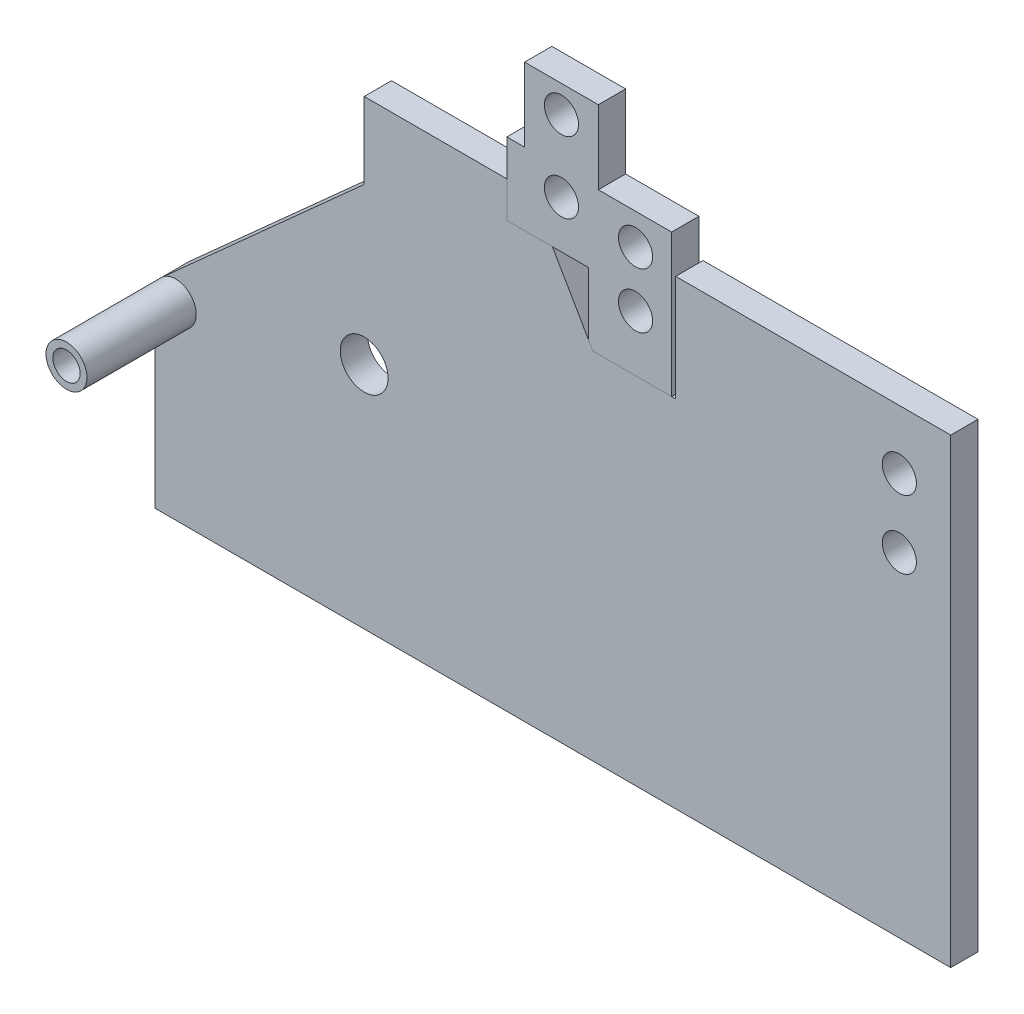
ISO-10303-21;
HEADER;
FILE_DESCRIPTION(('STEP AP214'),'2;1');
FILE_NAME('part.step','',(''),(''),'','','');
FILE_SCHEMA(('AUTOMOTIVE_DESIGN { 1 0 10303 214 1 1 1 1 }'));
ENDSEC;
DATA;
#1=APPLICATION_CONTEXT('core data for automotive mechanical design processes');
#2=APPLICATION_PROTOCOL_DEFINITION('international standard','automotive_design',2000,#1);
#3=PRODUCT_CONTEXT('',#1,'mechanical');
#4=PRODUCT('Part','Part','',(#3));
#5=PRODUCT_RELATED_PRODUCT_CATEGORY('part','',(#4));
#6=PRODUCT_DEFINITION_FORMATION('','',#4);
#7=PRODUCT_DEFINITION_CONTEXT('part definition',#1,'design');
#8=PRODUCT_DEFINITION('design','',#6,#7);
#9=PRODUCT_DEFINITION_SHAPE('','',#8);
#10=(LENGTH_UNIT() NAMED_UNIT(*) SI_UNIT(.MILLI.,.METRE.));
#11=(NAMED_UNIT(*) PLANE_ANGLE_UNIT() SI_UNIT($,.RADIAN.));
#12=(NAMED_UNIT(*) SI_UNIT($,.STERADIAN.) SOLID_ANGLE_UNIT());
#13=UNCERTAINTY_MEASURE_WITH_UNIT(LENGTH_MEASURE(1.E-05),#10,'distance_accuracy_value','');
#14=(GEOMETRIC_REPRESENTATION_CONTEXT(3) GLOBAL_UNCERTAINTY_ASSIGNED_CONTEXT((#13)) GLOBAL_UNIT_ASSIGNED_CONTEXT((#10,
#11,#12)) REPRESENTATION_CONTEXT('',''));
#15=CARTESIAN_POINT('',(0.,0.,0.));
#16=DIRECTION('',(0.,0.,1.));
#17=DIRECTION('',(1.,0.,0.));
#18=AXIS2_PLACEMENT_3D('',#15,#16,#17);
#19=CARTESIAN_POINT('',(0.,260.,0.));
#20=DIRECTION('',(0.,1.,0.));
#21=DIRECTION('',(0.,0.,1.));
#22=AXIS2_PLACEMENT_3D('',#19,#20,#21);
#23=PLANE('',#22);
#24=DIRECTION('',(-1.,0.,0.));
#25=VECTOR('',#24,1.);
#26=CARTESIAN_POINT('',(0.,260.,20.));
#27=LINE('',#26,#25);
#28=CARTESIAN_POINT('',(378.12049576549,260.,20.));
#29=VERTEX_POINT('',#28);
#30=CARTESIAN_POINT('',(320.509364461751,260.,20.));
#31=VERTEX_POINT('',#30);
#32=EDGE_CURVE('E249',#29,#31,#27,.T.);
#33=ORIENTED_EDGE('',*,*,#32,.T.);
#34=DIRECTION('',(0.,0.,1.));
#35=VECTOR('',#34,1.);
#36=CARTESIAN_POINT('',(320.509364461751,260.,0.));
#37=LINE('',#36,#35);
#38=CARTESIAN_POINT('',(320.509364461751,260.,0.));
#39=VERTEX_POINT('',#38);
#40=EDGE_CURVE('E13',#39,#31,#37,.T.);
#41=ORIENTED_EDGE('',*,*,#40,.F.);
#42=DIRECTION('',(-1.,0.,0.));
#43=VECTOR('',#42,1.);
#44=CARTESIAN_POINT('',(0.,260.,0.));
#45=LINE('',#44,#43);
#46=CARTESIAN_POINT('',(378.12049576549,260.,0.));
#47=VERTEX_POINT('',#46);
#48=EDGE_CURVE('E285',#47,#39,#45,.T.);
#49=ORIENTED_EDGE('',*,*,#48,.F.);
#50=DIRECTION('',(0.,0.,1.));
#51=VECTOR('',#50,1.);
#52=CARTESIAN_POINT('',(378.12049576549,260.,0.));
#53=LINE('',#52,#51);
#54=EDGE_CURVE('E124',#47,#29,#53,.T.);
#55=ORIENTED_EDGE('',*,*,#54,.T.);
#56=EDGE_LOOP('',(#33,#41,#49,#55));
#57=FACE_BOUND('',#56,.T.);
#58=ADVANCED_FACE('F121',(#57),#23,.F.);
#59=CARTESIAN_POINT('',(352.96532583829,203.784625887341,0.));
#60=DIRECTION('',(0.866025403784438,0.5,0.));
#61=DIRECTION('',(-0.5,0.866025403784438,0.));
#62=AXIS2_PLACEMENT_3D('',#59,#60,#61);
#63=PLANE('',#62);
#64=DIRECTION('',(-0.5,0.866025403784438,0.));
#65=VECTOR('',#64,1.);
#66=CARTESIAN_POINT('',(352.96532583829,203.784625887341,20.));
#67=LINE('',#66,#65);
#68=CARTESIAN_POINT('',(317.180522157063,265.765724002103,20.));
#69=VERTEX_POINT('',#68);
#70=EDGE_CURVE('E173',#31,#69,#67,.T.);
#71=ORIENTED_EDGE('',*,*,#70,.T.);
#72=DIRECTION('',(0.,0.,1.));
#73=VECTOR('',#72,1.);
#74=CARTESIAN_POINT('',(317.180522157063,265.765724002103,0.));
#75=LINE('',#74,#73);
#76=CARTESIAN_POINT('',(317.180522157063,265.765724002103,0.));
#77=VERTEX_POINT('',#76);
#78=EDGE_CURVE('E130',#77,#69,#75,.T.);
#79=ORIENTED_EDGE('',*,*,#78,.F.);
#80=DIRECTION('',(-0.5,0.866025403784438,0.));
#81=VECTOR('',#80,1.);
#82=CARTESIAN_POINT('',(352.96532583829,203.784625887341,0.));
#83=LINE('',#82,#81);
#84=EDGE_CURVE('E138',#39,#77,#83,.T.);
#85=ORIENTED_EDGE('',*,*,#84,.F.);
#86=ORIENTED_EDGE('',*,*,#40,.T.);
#87=EDGE_LOOP('',(#71,#79,#85,#86));
#88=FACE_BOUND('',#87,.T.);
#89=ADVANCED_FACE('F323',(#88),#63,.F.);
#90=CARTESIAN_POINT('',(317.180522157063,0.,0.));
#91=DIRECTION('',(1.,0.,0.));
#92=DIRECTION('',(0.,0.,-1.));
#93=AXIS2_PLACEMENT_3D('',#90,#91,#92);
#94=PLANE('',#93);
#95=DIRECTION('',(0.,1.,0.));
#96=VECTOR('',#95,1.);
#97=CARTESIAN_POINT('',(317.180522157063,0.,20.));
#98=LINE('',#97,#96);
#99=CARTESIAN_POINT('',(317.180522157063,311.384042750519,20.));
#100=VERTEX_POINT('',#99);
#101=EDGE_CURVE('E222',#69,#100,#98,.T.);
#102=ORIENTED_EDGE('',*,*,#101,.T.);
#103=DIRECTION('',(0.,0.,1.));
#104=VECTOR('',#103,1.);
#105=CARTESIAN_POINT('',(317.180522157063,311.384042750519,0.));
#106=LINE('',#105,#104);
#107=CARTESIAN_POINT('',(317.180522157063,311.384042750519,0.));
#108=VERTEX_POINT('',#107);
#109=EDGE_CURVE('E220',#108,#100,#106,.T.);
#110=ORIENTED_EDGE('',*,*,#109,.F.);
#111=DIRECTION('',(0.,1.,0.));
#112=VECTOR('',#111,1.);
#113=CARTESIAN_POINT('',(317.180522157063,0.,0.));
#114=LINE('',#113,#112);
#115=EDGE_CURVE('E209',#77,#108,#114,.T.);
#116=ORIENTED_EDGE('',*,*,#115,.F.);
#117=ORIENTED_EDGE('',*,*,#78,.T.);
#118=EDGE_LOOP('',(#102,#110,#116,#117));
#119=FACE_BOUND('',#118,.T.);
#120=ADVANCED_FACE('F221',(#119),#94,.F.);
#121=CARTESIAN_POINT('',(0.,311.384042750519,0.));
#122=DIRECTION('',(0.,1.,0.));
#123=DIRECTION('',(0.,0.,1.));
#124=AXIS2_PLACEMENT_3D('',#121,#122,#123);
#125=PLANE('',#124);
#126=DIRECTION('',(-1.,0.,0.));
#127=VECTOR('',#126,1.);
#128=CARTESIAN_POINT('',(0.,311.384042750519,20.));
#129=LINE('',#128,#127);
#130=CARTESIAN_POINT('',(257.46049576549,311.384042750519,20.));
#131=VERTEX_POINT('',#130);
#132=EDGE_CURVE('E270',#100,#131,#129,.T.);
#133=ORIENTED_EDGE('',*,*,#132,.T.);
#134=DIRECTION('',(0.,0.,1.));
#135=VECTOR('',#134,1.);
#136=CARTESIAN_POINT('',(257.46049576549,311.384042750519,0.));
#137=LINE('',#136,#135);
#138=CARTESIAN_POINT('',(257.46049576549,311.384042750519,0.));
#139=VERTEX_POINT('',#138);
#140=EDGE_CURVE('E226',#139,#131,#137,.T.);
#141=ORIENTED_EDGE('',*,*,#140,.F.);
#142=DIRECTION('',(-1.,0.,0.));
#143=VECTOR('',#142,1.);
#144=CARTESIAN_POINT('',(0.,311.384042750519,0.));
#145=LINE('',#144,#143);
#146=EDGE_CURVE('E215',#108,#139,#145,.T.);
#147=ORIENTED_EDGE('',*,*,#146,.F.);
#148=ORIENTED_EDGE('',*,*,#109,.T.);
#149=EDGE_LOOP('',(#133,#141,#147,#148));
#150=FACE_BOUND('',#149,.T.);
#151=ADVANCED_FACE('F228',(#150),#125,.F.);
#152=CARTESIAN_POINT('',(257.46049576549,0.,0.));
#153=DIRECTION('',(-1.,0.,0.));
#154=DIRECTION('',(0.,0.,1.));
#155=AXIS2_PLACEMENT_3D('',#152,#153,#154);
#156=PLANE('',#155);
#157=DIRECTION('',(0.,-1.,0.));
#158=VECTOR('',#157,1.);
#159=CARTESIAN_POINT('',(257.46049576549,0.,20.));
#160=LINE('',#159,#158);
#161=CARTESIAN_POINT('',(257.46049576549,364.320187298071,20.));
#162=VERTEX_POINT('',#161);
#163=EDGE_CURVE('E267',#162,#131,#160,.T.);
#164=ORIENTED_EDGE('',*,*,#163,.F.);
#165=DIRECTION('',(0.,0.,1.));
#166=VECTOR('',#165,1.);
#167=CARTESIAN_POINT('',(257.46049576549,364.320187298071,0.));
#168=LINE('',#167,#166);
#169=CARTESIAN_POINT('',(257.46049576549,364.320187298071,0.));
#170=VERTEX_POINT('',#169);
#171=EDGE_CURVE('E289',#170,#162,#168,.T.);
#172=ORIENTED_EDGE('',*,*,#171,.F.);
#173=DIRECTION('',(0.,-1.,0.));
#174=VECTOR('',#173,1.);
#175=CARTESIAN_POINT('',(257.46049576549,0.,0.));
#176=LINE('',#175,#174);
#177=EDGE_CURVE('E230',#170,#139,#176,.T.);
#178=ORIENTED_EDGE('',*,*,#177,.T.);
#179=ORIENTED_EDGE('',*,*,#140,.T.);
#180=EDGE_LOOP('',(#164,#172,#178,#179));
#181=FACE_BOUND('',#180,.T.);
#182=ADVANCED_FACE('F336',(#181),#156,.T.);
#183=CARTESIAN_POINT('',(0.,364.320187298071,0.));
#184=DIRECTION('',(0.,-1.,0.));
#185=DIRECTION('',(0.,0.,-1.));
#186=AXIS2_PLACEMENT_3D('',#183,#184,#185);
#187=PLANE('',#186);
#188=DIRECTION('',(1.,0.,0.));
#189=VECTOR('',#188,1.);
#190=CARTESIAN_POINT('',(0.,364.320187298071,20.));
#191=LINE('',#190,#189);
#192=CARTESIAN_POINT('',(270.46049576549,364.320187298071,20.));
#193=VERTEX_POINT('',#192);
#194=EDGE_CURVE('E265',#162,#193,#191,.T.);
#195=ORIENTED_EDGE('',*,*,#194,.T.);
#196=DIRECTION('',(0.,0.,1.));
#197=VECTOR('',#196,1.);
#198=CARTESIAN_POINT('',(270.46049576549,364.320187298071,0.));
#199=LINE('',#198,#197);
#200=CARTESIAN_POINT('',(270.46049576549,364.320187298071,0.));
#201=VERTEX_POINT('',#200);
#202=EDGE_CURVE('E291',#201,#193,#199,.T.);
#203=ORIENTED_EDGE('',*,*,#202,.F.);
#204=DIRECTION('',(1.,0.,0.));
#205=VECTOR('',#204,1.);
#206=CARTESIAN_POINT('',(0.,364.320187298071,0.));
#207=LINE('',#206,#205);
#208=EDGE_CURVE('E232',#170,#201,#207,.T.);
#209=ORIENTED_EDGE('',*,*,#208,.F.);
#210=ORIENTED_EDGE('',*,*,#171,.T.);
#211=EDGE_LOOP('',(#195,#203,#209,#210));
#212=FACE_BOUND('',#211,.T.);
#213=ADVANCED_FACE('F339',(#212),#187,.F.);
#214=CARTESIAN_POINT('',(270.46049576549,0.,0.));
#215=DIRECTION('',(1.,0.,0.));
#216=DIRECTION('',(0.,0.,-1.));
#217=AXIS2_PLACEMENT_3D('',#214,#215,#216);
#218=PLANE('',#217);
#219=DIRECTION('',(0.,1.,0.));
#220=VECTOR('',#219,1.);
#221=CARTESIAN_POINT('',(270.46049576549,0.,20.));
#222=LINE('',#221,#220);
#223=CARTESIAN_POINT('',(270.46049576549,418.251615442449,20.));
#224=VERTEX_POINT('',#223);
#225=EDGE_CURVE('E263',#193,#224,#222,.T.);
#226=ORIENTED_EDGE('',*,*,#225,.T.);
#227=DIRECTION('',(0.,0.,1.));
#228=VECTOR('',#227,1.);
#229=CARTESIAN_POINT('',(270.46049576549,418.251615442449,0.));
#230=LINE('',#229,#228);
#231=CARTESIAN_POINT('',(270.46049576549,418.251615442449,0.));
#232=VERTEX_POINT('',#231);
#233=EDGE_CURVE('E294',#232,#224,#230,.T.);
#234=ORIENTED_EDGE('',*,*,#233,.F.);
#235=DIRECTION('',(0.,1.,0.));
#236=VECTOR('',#235,1.);
#237=CARTESIAN_POINT('',(270.46049576549,0.,0.));
#238=LINE('',#237,#236);
#239=EDGE_CURVE('E377',#201,#232,#238,.T.);
#240=ORIENTED_EDGE('',*,*,#239,.F.);
#241=ORIENTED_EDGE('',*,*,#202,.T.);
#242=EDGE_LOOP('',(#226,#234,#240,#241));
#243=FACE_BOUND('',#242,.T.);
#244=ADVANCED_FACE('F343',(#243),#218,.F.);
#245=CARTESIAN_POINT('',(0.,418.251615442449,0.));
#246=DIRECTION('',(0.,-1.,0.));
#247=DIRECTION('',(0.,0.,-1.));
#248=AXIS2_PLACEMENT_3D('',#245,#246,#247);
#249=PLANE('',#248);
#250=DIRECTION('',(1.,0.,0.));
#251=VECTOR('',#250,1.);
#252=CARTESIAN_POINT('',(0.,418.251615442449,20.));
#253=LINE('',#252,#251);
#254=CARTESIAN_POINT('',(324.46049576549,418.251615442449,20.));
#255=VERTEX_POINT('',#254);
#256=EDGE_CURVE('E261',#224,#255,#253,.T.);
#257=ORIENTED_EDGE('',*,*,#256,.T.);
#258=DIRECTION('',(0.,0.,1.));
#259=VECTOR('',#258,1.);
#260=CARTESIAN_POINT('',(324.46049576549,418.251615442449,0.));
#261=LINE('',#260,#259);
#262=CARTESIAN_POINT('',(324.46049576549,418.251615442449,0.));
#263=VERTEX_POINT('',#262);
#264=EDGE_CURVE('E297',#263,#255,#261,.T.);
#265=ORIENTED_EDGE('',*,*,#264,.F.);
#266=DIRECTION('',(1.,0.,0.));
#267=VECTOR('',#266,1.);
#268=CARTESIAN_POINT('',(0.,418.251615442449,0.));
#269=LINE('',#268,#267);
#270=EDGE_CURVE('E374',#232,#263,#269,.T.);
#271=ORIENTED_EDGE('',*,*,#270,.F.);
#272=ORIENTED_EDGE('',*,*,#233,.T.);
#273=EDGE_LOOP('',(#257,#265,#271,#272));
#274=FACE_BOUND('',#273,.T.);
#275=ADVANCED_FACE('F347',(#274),#249,.F.);
#276=CARTESIAN_POINT('',(324.46049576549,0.,0.));
#277=DIRECTION('',(-1.,0.,0.));
#278=DIRECTION('',(0.,0.,1.));
#279=AXIS2_PLACEMENT_3D('',#276,#277,#278);
#280=PLANE('',#279);
#281=DIRECTION('',(0.,-1.,0.));
#282=VECTOR('',#281,1.);
#283=CARTESIAN_POINT('',(324.46049576549,0.,20.));
#284=LINE('',#283,#282);
#285=CARTESIAN_POINT('',(324.46049576549,364.320187298071,20.));
#286=VERTEX_POINT('',#285);
#287=EDGE_CURVE('E258',#255,#286,#284,.T.);
#288=ORIENTED_EDGE('',*,*,#287,.T.);
#289=DIRECTION('',(0.,0.,1.));
#290=VECTOR('',#289,1.);
#291=CARTESIAN_POINT('',(324.46049576549,364.320187298071,0.));
#292=LINE('',#291,#290);
#293=CARTESIAN_POINT('',(324.46049576549,364.320187298071,0.));
#294=VERTEX_POINT('',#293);
#295=EDGE_CURVE('E300',#294,#286,#292,.T.);
#296=ORIENTED_EDGE('',*,*,#295,.F.);
#297=DIRECTION('',(0.,-1.,0.));
#298=VECTOR('',#297,1.);
#299=CARTESIAN_POINT('',(324.46049576549,0.,0.));
#300=LINE('',#299,#298);
#301=EDGE_CURVE('E372',#263,#294,#300,.T.);
#302=ORIENTED_EDGE('',*,*,#301,.F.);
#303=ORIENTED_EDGE('',*,*,#264,.T.);
#304=EDGE_LOOP('',(#288,#296,#302,#303));
#305=FACE_BOUND('',#304,.T.);
#306=ADVANCED_FACE('F351',(#305),#280,.F.);
#307=CARTESIAN_POINT('',(0.,364.320187298071,0.));
#308=DIRECTION('',(0.,1.,0.));
#309=DIRECTION('',(0.,0.,1.));
#310=AXIS2_PLACEMENT_3D('',#307,#308,#309);
#311=PLANE('',#310);
#312=DIRECTION('',(-1.,0.,0.));
#313=VECTOR('',#312,1.);
#314=CARTESIAN_POINT('',(0.,364.320187298071,20.));
#315=LINE('',#314,#313);
#316=CARTESIAN_POINT('',(378.12049576549,364.320187298071,20.));
#317=VERTEX_POINT('',#316);
#318=EDGE_CURVE('E255',#317,#286,#315,.T.);
#319=ORIENTED_EDGE('',*,*,#318,.F.);
#320=DIRECTION('',(0.,0.,1.));
#321=VECTOR('',#320,1.);
#322=CARTESIAN_POINT('',(378.12049576549,364.320187298071,0.));
#323=LINE('',#322,#321);
#324=CARTESIAN_POINT('',(378.12049576549,364.320187298071,0.));
#325=VERTEX_POINT('',#324);
#326=EDGE_CURVE('E301',#325,#317,#323,.T.);
#327=ORIENTED_EDGE('',*,*,#326,.F.);
#328=DIRECTION('',(-1.,0.,0.));
#329=VECTOR('',#328,1.);
#330=CARTESIAN_POINT('',(0.,364.320187298071,0.));
#331=LINE('',#330,#329);
#332=EDGE_CURVE('E386',#325,#294,#331,.T.);
#333=ORIENTED_EDGE('',*,*,#332,.T.);
#334=ORIENTED_EDGE('',*,*,#295,.T.);
#335=EDGE_LOOP('',(#319,#327,#333,#334));
#336=FACE_BOUND('',#335,.T.);
#337=ADVANCED_FACE('F354',(#336),#311,.T.);
#338=CARTESIAN_POINT('',(297.46049576549,346.134042750519,0.));
#339=DIRECTION('',(0.,0.,1.));
#340=DIRECTION('',(1.,0.,0.));
#341=AXIS2_PLACEMENT_3D('',#338,#339,#340);
#342=CYLINDRICAL_SURFACE('',#341,12.5);
#343=CARTESIAN_POINT('',(297.46049576549,346.134042750519,0.));
#344=DIRECTION('',(0.,0.,1.));
#345=DIRECTION('',(1.,0.,0.));
#346=AXIS2_PLACEMENT_3D('',#343,#344,#345);
#347=CIRCLE('',#346,12.5);
#348=CARTESIAN_POINT('',(309.96049576549,346.134042750519,0.));
#349=VERTEX_POINT('',#348);
#350=EDGE_CURVE('E243',#349,#349,#347,.T.);
#351=ORIENTED_EDGE('',*,*,#350,.F.);
#352=EDGE_LOOP('',(#351));
#353=FACE_BOUND('',#352,.T.);
#354=CARTESIAN_POINT('',(297.46049576549,346.134042750519,20.));
#355=DIRECTION('',(0.,0.,1.));
#356=DIRECTION('',(1.,0.,0.));
#357=AXIS2_PLACEMENT_3D('',#354,#355,#356);
#358=CIRCLE('',#357,12.5);
#359=CARTESIAN_POINT('',(309.96049576549,346.134042750519,20.));
#360=VERTEX_POINT('',#359);
#361=EDGE_CURVE('E280',#360,#360,#358,.T.);
#362=ORIENTED_EDGE('',*,*,#361,.T.);
#363=EDGE_LOOP('',(#362));
#364=FACE_BOUND('',#363,.T.);
#365=ADVANCED_FACE('F357',(#353,#364),#342,.F.);
#366=CARTESIAN_POINT('',(351.71049576549,341.56,0.));
#367=DIRECTION('',(0.,0.,1.));
#368=DIRECTION('',(1.,0.,0.));
#369=AXIS2_PLACEMENT_3D('',#366,#367,#368);
#370=CYLINDRICAL_SURFACE('',#369,12.5);
#371=CARTESIAN_POINT('',(351.71049576549,341.56,0.));
#372=DIRECTION('',(0.,0.,1.));
#373=DIRECTION('',(1.,0.,0.));
#374=AXIS2_PLACEMENT_3D('',#371,#372,#373);
#375=CIRCLE('',#374,12.5);
#376=CARTESIAN_POINT('',(364.21049576549,341.56,0.));
#377=VERTEX_POINT('',#376);
#378=EDGE_CURVE('E240',#377,#377,#375,.T.);
#379=ORIENTED_EDGE('',*,*,#378,.F.);
#380=EDGE_LOOP('',(#379));
#381=FACE_BOUND('',#380,.T.);
#382=CARTESIAN_POINT('',(351.71049576549,341.56,20.));
#383=DIRECTION('',(0.,0.,1.));
#384=DIRECTION('',(1.,0.,0.));
#385=AXIS2_PLACEMENT_3D('',#382,#383,#384);
#386=CIRCLE('',#385,12.5);
#387=CARTESIAN_POINT('',(364.21049576549,341.56,20.));
#388=VERTEX_POINT('',#387);
#389=EDGE_CURVE('E277',#388,#388,#386,.T.);
#390=ORIENTED_EDGE('',*,*,#389,.T.);
#391=EDGE_LOOP('',(#390));
#392=FACE_BOUND('',#391,.T.);
#393=ADVANCED_FACE('F318',(#381,#392),#370,.F.);
#394=CARTESIAN_POINT('',(297.46049576549,398.384042750519,0.));
#395=DIRECTION('',(0.,0.,1.));
#396=DIRECTION('',(1.,0.,0.));
#397=AXIS2_PLACEMENT_3D('',#394,#395,#396);
#398=CYLINDRICAL_SURFACE('',#397,12.5);
#399=CARTESIAN_POINT('',(297.46049576549,398.384042750519,0.));
#400=DIRECTION('',(0.,0.,1.));
#401=DIRECTION('',(1.,0.,0.));
#402=AXIS2_PLACEMENT_3D('',#399,#400,#401);
#403=CIRCLE('',#402,12.5);
#404=CARTESIAN_POINT('',(309.96049576549,398.384042750519,0.));
#405=VERTEX_POINT('',#404);
#406=EDGE_CURVE('E237',#405,#405,#403,.T.);
#407=ORIENTED_EDGE('',*,*,#406,.F.);
#408=EDGE_LOOP('',(#407));
#409=FACE_BOUND('',#408,.T.);
#410=CARTESIAN_POINT('',(297.46049576549,398.384042750519,20.));
#411=DIRECTION('',(0.,0.,1.));
#412=DIRECTION('',(1.,0.,0.));
#413=AXIS2_PLACEMENT_3D('',#410,#411,#412);
#414=CIRCLE('',#413,12.5);
#415=CARTESIAN_POINT('',(309.96049576549,398.384042750519,20.));
#416=VERTEX_POINT('',#415);
#417=EDGE_CURVE('E274',#416,#416,#414,.T.);
#418=ORIENTED_EDGE('',*,*,#417,.T.);
#419=EDGE_LOOP('',(#418));
#420=FACE_BOUND('',#419,.T.);
#421=ADVANCED_FACE('F311',(#409,#420),#398,.F.);
#422=CARTESIAN_POINT('',(378.12049576549,0.,0.));
#423=DIRECTION('',(1.,0.,0.));
#424=DIRECTION('',(0.,0.,-1.));
#425=AXIS2_PLACEMENT_3D('',#422,#423,#424);
#426=PLANE('',#425);
#427=DIRECTION('',(0.,1.,0.));
#428=VECTOR('',#427,1.);
#429=CARTESIAN_POINT('',(378.12049576549,0.,20.));
#430=LINE('',#429,#428);
#431=EDGE_CURVE('E252',#29,#317,#430,.T.);
#432=ORIENTED_EDGE('',*,*,#431,.F.);
#433=ORIENTED_EDGE('',*,*,#54,.F.);
#434=DIRECTION('',(0.,1.,0.));
#435=VECTOR('',#434,1.);
#436=CARTESIAN_POINT('',(378.12049576549,0.,0.));
#437=LINE('',#436,#435);
#438=EDGE_CURVE('E388',#47,#325,#437,.T.);
#439=ORIENTED_EDGE('',*,*,#438,.T.);
#440=ORIENTED_EDGE('',*,*,#326,.T.);
#441=EDGE_LOOP('',(#432,#433,#439,#440));
#442=FACE_BOUND('',#441,.T.);
#443=ADVANCED_FACE('F308',(#442),#426,.T.);
#444=CARTESIAN_POINT('',(351.71049576549,301.,0.));
#445=DIRECTION('',(0.,0.,1.));
#446=DIRECTION('',(1.,0.,0.));
#447=AXIS2_PLACEMENT_3D('',#444,#445,#446);
#448=CYLINDRICAL_SURFACE('',#447,12.5);
#449=CARTESIAN_POINT('',(351.71049576549,301.,0.));
#450=DIRECTION('',(0.,0.,1.));
#451=DIRECTION('',(1.,0.,0.));
#452=AXIS2_PLACEMENT_3D('',#449,#450,#451);
#453=CIRCLE('',#452,12.5);
#454=CARTESIAN_POINT('',(364.21049576549,301.,0.));
#455=VERTEX_POINT('',#454);
#456=EDGE_CURVE('E246',#455,#455,#453,.T.);
#457=ORIENTED_EDGE('',*,*,#456,.F.);
#458=EDGE_LOOP('',(#457));
#459=FACE_BOUND('',#458,.T.);
#460=CARTESIAN_POINT('',(351.71049576549,301.,20.));
#461=DIRECTION('',(0.,0.,1.));
#462=DIRECTION('',(1.,0.,0.));
#463=AXIS2_PLACEMENT_3D('',#460,#461,#462);
#464=CIRCLE('',#463,12.5);
#465=CARTESIAN_POINT('',(364.21049576549,301.,20.));
#466=VERTEX_POINT('',#465);
#467=EDGE_CURVE('E283',#466,#466,#464,.T.);
#468=ORIENTED_EDGE('',*,*,#467,.T.);
#469=EDGE_LOOP('',(#468));
#470=FACE_BOUND('',#469,.T.);
#471=ADVANCED_FACE('F310',(#459,#470),#448,.F.);
#472=CARTESIAN_POINT('',(0.,0.,0.));
#473=DIRECTION('',(0.,0.,1.));
#474=DIRECTION('',(1.,0.,0.));
#475=AXIS2_PLACEMENT_3D('',#472,#473,#474);
#476=PLANE('',#475);
#477=ORIENTED_EDGE('',*,*,#48,.T.);
#478=ORIENTED_EDGE('',*,*,#84,.T.);
#479=ORIENTED_EDGE('',*,*,#115,.T.);
#480=ORIENTED_EDGE('',*,*,#146,.T.);
#481=ORIENTED_EDGE('',*,*,#177,.F.);
#482=ORIENTED_EDGE('',*,*,#208,.T.);
#483=ORIENTED_EDGE('',*,*,#239,.T.);
#484=ORIENTED_EDGE('',*,*,#270,.T.);
#485=ORIENTED_EDGE('',*,*,#301,.T.);
#486=ORIENTED_EDGE('',*,*,#332,.F.);
#487=ORIENTED_EDGE('',*,*,#438,.F.);
#488=EDGE_LOOP('',(#477,#478,#479,#480,#481,#482,#483,#484,#485,#486,#487));
#489=FACE_BOUND('',#488,.T.);
#490=ORIENTED_EDGE('',*,*,#406,.T.);
#491=EDGE_LOOP('',(#490));
#492=FACE_BOUND('',#491,.T.);
#493=ORIENTED_EDGE('',*,*,#378,.T.);
#494=EDGE_LOOP('',(#493));
#495=FACE_BOUND('',#494,.T.);
#496=ORIENTED_EDGE('',*,*,#350,.T.);
#497=EDGE_LOOP('',(#496));
#498=FACE_BOUND('',#497,.T.);
#499=ORIENTED_EDGE('',*,*,#456,.T.);
#500=EDGE_LOOP('',(#499));
#501=FACE_BOUND('',#500,.T.);
#502=ADVANCED_FACE('F211',(#489,#492,#495,#498,#501),#476,.F.);
#503=CARTESIAN_POINT('',(0.,0.,20.));
#504=DIRECTION('',(0.,0.,1.));
#505=DIRECTION('',(1.,0.,0.));
#506=AXIS2_PLACEMENT_3D('',#503,#504,#505);
#507=PLANE('',#506);
#508=ORIENTED_EDGE('',*,*,#32,.F.);
#509=ORIENTED_EDGE('',*,*,#431,.T.);
#510=ORIENTED_EDGE('',*,*,#318,.T.);
#511=ORIENTED_EDGE('',*,*,#287,.F.);
#512=ORIENTED_EDGE('',*,*,#256,.F.);
#513=ORIENTED_EDGE('',*,*,#225,.F.);
#514=ORIENTED_EDGE('',*,*,#194,.F.);
#515=ORIENTED_EDGE('',*,*,#163,.T.);
#516=ORIENTED_EDGE('',*,*,#132,.F.);
#517=ORIENTED_EDGE('',*,*,#101,.F.);
#518=ORIENTED_EDGE('',*,*,#70,.F.);
#519=EDGE_LOOP('',(#508,#509,#510,#511,#512,#513,#514,#515,#516,#517,#518));
#520=FACE_BOUND('',#519,.T.);
#521=ORIENTED_EDGE('',*,*,#417,.F.);
#522=EDGE_LOOP('',(#521));
#523=FACE_BOUND('',#522,.T.);
#524=ORIENTED_EDGE('',*,*,#389,.F.);
#525=EDGE_LOOP('',(#524));
#526=FACE_BOUND('',#525,.T.);
#527=ORIENTED_EDGE('',*,*,#361,.F.);
#528=EDGE_LOOP('',(#527));
#529=FACE_BOUND('',#528,.T.);
#530=ORIENTED_EDGE('',*,*,#467,.F.);
#531=EDGE_LOOP('',(#530));
#532=FACE_BOUND('',#531,.T.);
#533=ADVANCED_FACE('F306',(#520,#523,#526,#529,#532),#507,.T.);
#534=CLOSED_SHELL('',(#58,#89,#120,#151,#182,#213,#244,#275,#306,#337,#365,#393,#421,#443,#471,
#502,#533));
#535=MANIFOLD_SOLID_BREP('B2',#534);
#536=CARTESIAN_POINT('',(153.,0.,20.));
#537=DIRECTION('',(-1.,0.,0.));
#538=DIRECTION('',(0.,0.,1.));
#539=AXIS2_PLACEMENT_3D('',#536,#537,#538);
#540=PLANE('',#539);
#541=DIRECTION('',(0.,1.,0.));
#542=VECTOR('',#541,1.);
#543=CARTESIAN_POINT('',(153.,0.,0.));
#544=LINE('',#543,#542);
#545=CARTESIAN_POINT('',(153.,281.918848090833,0.));
#546=VERTEX_POINT('',#545);
#547=CARTESIAN_POINT('',(153.,337.740187298071,0.));
#548=VERTEX_POINT('',#547);
#549=EDGE_CURVE('E743',#546,#548,#544,.T.);
#550=ORIENTED_EDGE('',*,*,#549,.F.);
#551=DIRECTION('',(0.,0.,-1.));
#552=VECTOR('',#551,1.);
#553=CARTESIAN_POINT('',(153.,281.918848090833,20.));
#554=LINE('',#553,#552);
#555=CARTESIAN_POINT('',(153.,281.918848090833,20.));
#556=VERTEX_POINT('',#555);
#557=EDGE_CURVE('E760',#556,#546,#554,.T.);
#558=ORIENTED_EDGE('',*,*,#557,.F.);
#559=DIRECTION('',(0.,1.,0.));
#560=VECTOR('',#559,1.);
#561=CARTESIAN_POINT('',(153.,0.,20.));
#562=LINE('',#561,#560);
#563=CARTESIAN_POINT('',(153.,337.740187298071,20.));
#564=VERTEX_POINT('',#563);
#565=EDGE_CURVE('E726',#556,#564,#562,.T.);
#566=ORIENTED_EDGE('',*,*,#565,.T.);
#567=DIRECTION('',(0.,0.,-1.));
#568=VECTOR('',#567,1.);
#569=CARTESIAN_POINT('',(153.,337.740187298071,20.));
#570=LINE('',#569,#568);
#571=EDGE_CURVE('E556',#564,#548,#570,.T.);
#572=ORIENTED_EDGE('',*,*,#571,.T.);
#573=EDGE_LOOP('',(#550,#558,#566,#572));
#574=FACE_BOUND('',#573,.T.);
#575=ADVANCED_FACE('F547',(#574),#540,.T.);
#576=CARTESIAN_POINT('',(-71.9216253841728,80.190761516644,20.));
#577=DIRECTION('',(-0.66768118292682,0.744447337268019,0.));
#578=DIRECTION('',(-0.744447337268019,-0.66768118292682,0.));
#579=AXIS2_PLACEMENT_3D('',#576,#577,#578);
#580=PLANE('',#579);
#581=DIRECTION('',(0.744447337268019,0.66768118292682,0.));
#582=VECTOR('',#581,1.);
#583=CARTESIAN_POINT('',(-71.9216253841728,80.190761516644,0.));
#584=LINE('',#583,#582);
#585=CARTESIAN_POINT('',(4.98478225609769,149.16671005902,0.));
#586=VERTEX_POINT('',#585);
#587=EDGE_CURVE('E746',#586,#546,#584,.T.);
#588=ORIENTED_EDGE('',*,*,#587,.F.);
#589=DIRECTION('',(0.,0.,-1.));
#590=VECTOR('',#589,1.);
#591=CARTESIAN_POINT('',(4.98478225609769,149.16671005902,20.));
#592=LINE('',#591,#590);
#593=CARTESIAN_POINT('',(4.9847822560977,149.16671005902,20.));
#594=VERTEX_POINT('',#593);
#595=EDGE_CURVE('E758',#594,#586,#592,.T.);
#596=ORIENTED_EDGE('',*,*,#595,.F.);
#597=DIRECTION('',(0.744447337268019,0.66768118292682,0.));
#598=VECTOR('',#597,1.);
#599=CARTESIAN_POINT('',(-71.9216253841728,80.190761516644,20.));
#600=LINE('',#599,#598);
#601=EDGE_CURVE('E729',#594,#556,#600,.T.);
#602=ORIENTED_EDGE('',*,*,#601,.T.);
#603=ORIENTED_EDGE('',*,*,#557,.T.);
#604=EDGE_LOOP('',(#588,#596,#602,#603));
#605=FACE_BOUND('',#604,.T.);
#606=ADVANCED_FACE('F783',(#605),#580,.T.);
#607=CARTESIAN_POINT('',(0.,0.,20.));
#608=DIRECTION('',(-1.,0.,0.));
#609=DIRECTION('',(0.,0.,1.));
#610=AXIS2_PLACEMENT_3D('',#607,#608,#609);
#611=PLANE('',#610);
#612=DIRECTION('',(0.,1.,0.));
#613=VECTOR('',#612,1.);
#614=CARTESIAN_POINT('',(0.,0.,0.));
#615=LINE('',#614,#613);
#616=CARTESIAN_POINT('',(0.,0.,0.));
#617=VERTEX_POINT('',#616);
#618=CARTESIAN_POINT('',(0.,138.,0.));
#619=VERTEX_POINT('',#618);
#620=EDGE_CURVE('E749',#617,#619,#615,.T.);
#621=ORIENTED_EDGE('',*,*,#620,.F.);
#622=DIRECTION('',(0.,0.,-1.));
#623=VECTOR('',#622,1.);
#624=CARTESIAN_POINT('',(0.,0.,20.));
#625=LINE('',#624,#623);
#626=CARTESIAN_POINT('',(0.,0.,20.));
#627=VERTEX_POINT('',#626);
#628=EDGE_CURVE('E754',#627,#617,#625,.T.);
#629=ORIENTED_EDGE('',*,*,#628,.F.);
#630=DIRECTION('',(0.,1.,0.));
#631=VECTOR('',#630,1.);
#632=CARTESIAN_POINT('',(0.,0.,20.));
#633=LINE('',#632,#631);
#634=CARTESIAN_POINT('',(0.,138.,20.));
#635=VERTEX_POINT('',#634);
#636=EDGE_CURVE('E732',#627,#635,#633,.T.);
#637=ORIENTED_EDGE('',*,*,#636,.T.);
#638=DIRECTION('',(0.,0.,-1.));
#639=VECTOR('',#638,1.);
#640=CARTESIAN_POINT('',(0.,138.,20.));
#641=LINE('',#640,#639);
#642=EDGE_CURVE('E756',#635,#619,#641,.T.);
#643=ORIENTED_EDGE('',*,*,#642,.T.);
#644=EDGE_LOOP('',(#621,#629,#637,#643));
#645=FACE_BOUND('',#644,.T.);
#646=ADVANCED_FACE('F775',(#645),#611,.T.);
#647=CARTESIAN_POINT('',(0.,0.,20.));
#648=DIRECTION('',(0.,1.,0.));
#649=DIRECTION('',(0.,0.,1.));
#650=AXIS2_PLACEMENT_3D('',#647,#648,#649);
#651=PLANE('',#650);
#652=DIRECTION('',(1.,0.,0.));
#653=VECTOR('',#652,1.);
#654=CARTESIAN_POINT('',(0.,0.,0.));
#655=LINE('',#654,#653);
#656=CARTESIAN_POINT('',(582.5,0.,0.));
#657=VERTEX_POINT('',#656);
#658=EDGE_CURVE('E654',#617,#657,#655,.T.);
#659=ORIENTED_EDGE('',*,*,#658,.T.);
#660=DIRECTION('',(0.,0.,-1.));
#661=VECTOR('',#660,1.);
#662=CARTESIAN_POINT('',(582.5,0.,20.));
#663=LINE('',#662,#661);
#664=CARTESIAN_POINT('',(582.5,0.,20.));
#665=VERTEX_POINT('',#664);
#666=EDGE_CURVE('E648',#665,#657,#663,.T.);
#667=ORIENTED_EDGE('',*,*,#666,.F.);
#668=DIRECTION('',(1.,0.,0.));
#669=VECTOR('',#668,1.);
#670=CARTESIAN_POINT('',(0.,0.,20.));
#671=LINE('',#670,#669);
#672=EDGE_CURVE('E735',#627,#665,#671,.T.);
#673=ORIENTED_EDGE('',*,*,#672,.F.);
#674=ORIENTED_EDGE('',*,*,#628,.T.);
#675=EDGE_LOOP('',(#659,#667,#673,#674));
#676=FACE_BOUND('',#675,.T.);
#677=ADVANCED_FACE('F845',(#676),#651,.F.);
#678=CARTESIAN_POINT('',(582.5,0.,20.));
#679=DIRECTION('',(-1.,0.,0.));
#680=DIRECTION('',(0.,0.,1.));
#681=AXIS2_PLACEMENT_3D('',#678,#679,#680);
#682=PLANE('',#681);
#683=DIRECTION('',(0.,1.,0.));
#684=VECTOR('',#683,1.);
#685=CARTESIAN_POINT('',(582.5,0.,0.));
#686=LINE('',#685,#684);
#687=CARTESIAN_POINT('',(582.5,337.740187298071,0.));
#688=VERTEX_POINT('',#687);
#689=EDGE_CURVE('E643',#657,#688,#686,.T.);
#690=ORIENTED_EDGE('',*,*,#689,.T.);
#691=DIRECTION('',(0.,0.,1.));
#692=VECTOR('',#691,1.);
#693=CARTESIAN_POINT('',(582.5,337.740187298071,0.));
#694=LINE('',#693,#692);
#695=CARTESIAN_POINT('',(582.5,337.740187298071,20.));
#696=VERTEX_POINT('',#695);
#697=EDGE_CURVE('E646',#688,#696,#694,.T.);
#698=ORIENTED_EDGE('',*,*,#697,.T.);
#699=DIRECTION('',(0.,1.,0.));
#700=VECTOR('',#699,1.);
#701=CARTESIAN_POINT('',(582.5,0.,20.));
#702=LINE('',#701,#700);
#703=EDGE_CURVE('E738',#665,#696,#702,.T.);
#704=ORIENTED_EDGE('',*,*,#703,.F.);
#705=ORIENTED_EDGE('',*,*,#666,.T.);
#706=EDGE_LOOP('',(#690,#698,#704,#705));
#707=FACE_BOUND('',#706,.T.);
#708=ADVANCED_FACE('F645',(#707),#682,.F.);
#709=CARTESIAN_POINT('',(153.,167.740187298071,20.));
#710=DIRECTION('',(0.,0.,-1.));
#711=DIRECTION('',(-1.,0.,0.));
#712=AXIS2_PLACEMENT_3D('',#709,#710,#711);
#713=CYLINDRICAL_SURFACE('',#712,17.5);
#714=CARTESIAN_POINT('',(153.,167.740187298071,20.));
#715=DIRECTION('',(0.,0.,1.));
#716=DIRECTION('',(1.,0.,0.));
#717=AXIS2_PLACEMENT_3D('',#714,#715,#716);
#718=CIRCLE('',#717,17.5);
#719=CARTESIAN_POINT('',(170.5,167.740187298071,20.));
#720=VERTEX_POINT('',#719);
#721=EDGE_CURVE('E653',#720,#720,#718,.T.);
#722=ORIENTED_EDGE('',*,*,#721,.T.);
#723=EDGE_LOOP('',(#722));
#724=FACE_BOUND('',#723,.T.);
#725=CARTESIAN_POINT('',(153.,167.740187298071,0.));
#726=DIRECTION('',(0.,0.,1.));
#727=DIRECTION('',(1.,0.,0.));
#728=AXIS2_PLACEMENT_3D('',#725,#726,#727);
#729=CIRCLE('',#728,17.5);
#730=CARTESIAN_POINT('',(170.5,167.740187298071,0.));
#731=VERTEX_POINT('',#730);
#732=EDGE_CURVE('E740',#731,#731,#729,.T.);
#733=ORIENTED_EDGE('',*,*,#732,.F.);
#734=EDGE_LOOP('',(#733));
#735=FACE_BOUND('',#734,.T.);
#736=ADVANCED_FACE('F817',(#724,#735),#713,.F.);
#737=CARTESIAN_POINT('',(0.,0.,0.));
#738=DIRECTION('',(0.,0.,1.));
#739=DIRECTION('',(1.,0.,0.));
#740=AXIS2_PLACEMENT_3D('',#737,#738,#739);
#741=PLANE('',#740);
#742=CARTESIAN_POINT('',(544.895661023303,294.516190979496,0.));
#743=DIRECTION('',(0.,0.,-1.));
#744=DIRECTION('',(-1.,0.,0.));
#745=AXIS2_PLACEMENT_3D('',#742,#743,#744);
#746=CIRCLE('',#745,12.5);
#747=CARTESIAN_POINT('',(532.395661023303,294.516190979496,0.));
#748=VERTEX_POINT('',#747);
#749=EDGE_CURVE('E1018',#748,#748,#746,.T.);
#750=ORIENTED_EDGE('',*,*,#749,.F.);
#751=EDGE_LOOP('',(#750));
#752=FACE_BOUND('',#751,.T.);
#753=CARTESIAN_POINT('',(544.895661023303,244.516190979496,0.));
#754=DIRECTION('',(0.,0.,-1.));
#755=DIRECTION('',(-1.,0.,0.));
#756=AXIS2_PLACEMENT_3D('',#753,#754,#755);
#757=CIRCLE('',#756,12.5);
#758=CARTESIAN_POINT('',(532.395661023303,244.516190979496,0.));
#759=VERTEX_POINT('',#758);
#760=EDGE_CURVE('E679',#759,#759,#757,.T.);
#761=ORIENTED_EDGE('',*,*,#760,.F.);
#762=EDGE_LOOP('',(#761));
#763=FACE_BOUND('',#762,.T.);
#764=DIRECTION('',(0.5,-0.866025403784438,0.));
#765=VECTOR('',#764,1.);
#766=CARTESIAN_POINT('',(352.96532583829,203.784625887341,0.));
#767=LINE('',#766,#765);
#768=CARTESIAN_POINT('',(290.842773547687,311.384042750519,0.));
#769=VERTEX_POINT('',#768);
#770=CARTESIAN_POINT('',(320.509364461751,260.,0.));
#771=VERTEX_POINT('',#770);
#772=EDGE_CURVE('E698',#769,#771,#767,.T.);
#773=ORIENTED_EDGE('',*,*,#772,.T.);
#774=DIRECTION('',(-1.,0.,0.));
#775=VECTOR('',#774,1.);
#776=CARTESIAN_POINT('',(320.509364461751,260.,0.));
#777=LINE('',#776,#775);
#778=CARTESIAN_POINT('',(381.119364461751,260.,0.));
#779=VERTEX_POINT('',#778);
#780=EDGE_CURVE('E664',#779,#771,#777,.T.);
#781=ORIENTED_EDGE('',*,*,#780,.F.);
#782=DIRECTION('',(0.,-1.,0.));
#783=VECTOR('',#782,1.);
#784=CARTESIAN_POINT('',(381.119364461751,260.,0.));
#785=LINE('',#784,#783);
#786=CARTESIAN_POINT('',(381.119364461751,337.740187298071,0.));
#787=VERTEX_POINT('',#786);
#788=EDGE_CURVE('E671',#787,#779,#785,.T.);
#789=ORIENTED_EDGE('',*,*,#788,.F.);
#790=DIRECTION('',(-1.,0.,0.));
#791=VECTOR('',#790,1.);
#792=CARTESIAN_POINT('',(582.5,337.740187298071,0.));
#793=LINE('',#792,#791);
#794=EDGE_CURVE('E659',#688,#787,#793,.T.);
#795=ORIENTED_EDGE('',*,*,#794,.F.);
#796=ORIENTED_EDGE('',*,*,#689,.F.);
#797=ORIENTED_EDGE('',*,*,#658,.F.);
#798=ORIENTED_EDGE('',*,*,#620,.T.);
#799=CARTESIAN_POINT('',(15.,138.,0.));
#800=DIRECTION('',(0.,0.,1.));
#801=DIRECTION('',(1.,0.,0.));
#802=AXIS2_PLACEMENT_3D('',#799,#800,#801);
#803=CIRCLE('',#802,15.);
#804=EDGE_CURVE('E551',#586,#619,#803,.T.);
#805=ORIENTED_EDGE('',*,*,#804,.F.);
#806=ORIENTED_EDGE('',*,*,#587,.T.);
#807=ORIENTED_EDGE('',*,*,#549,.T.);
#808=DIRECTION('',(1.,0.,0.));
#809=VECTOR('',#808,1.);
#810=CARTESIAN_POINT('',(0.,337.740187298071,0.));
#811=LINE('',#810,#809);
#812=CARTESIAN_POINT('',(257.46049576549,337.740187298071,0.));
#813=VERTEX_POINT('',#812);
#814=EDGE_CURVE('E695',#548,#813,#811,.T.);
#815=ORIENTED_EDGE('',*,*,#814,.T.);
#816=DIRECTION('',(0.,-1.,0.));
#817=VECTOR('',#816,1.);
#818=CARTESIAN_POINT('',(257.46049576549,0.,0.));
#819=LINE('',#818,#817);
#820=CARTESIAN_POINT('',(257.46049576549,311.384042750519,0.));
#821=VERTEX_POINT('',#820);
#822=EDGE_CURVE('E693',#813,#821,#819,.T.);
#823=ORIENTED_EDGE('',*,*,#822,.T.);
#824=DIRECTION('',(-1.,0.,0.));
#825=VECTOR('',#824,1.);
#826=CARTESIAN_POINT('',(0.,311.384042750519,0.));
#827=LINE('',#826,#825);
#828=EDGE_CURVE('E700',#769,#821,#827,.T.);
#829=ORIENTED_EDGE('',*,*,#828,.F.);
#830=EDGE_LOOP('',(#773,#781,#789,#795,#796,#797,#798,#805,#806,#807,#815,#823,#829));
#831=FACE_BOUND('',#830,.T.);
#832=ORIENTED_EDGE('',*,*,#732,.T.);
#833=EDGE_LOOP('',(#832));
#834=FACE_BOUND('',#833,.T.);
#835=CARTESIAN_POINT('',(15.,138.,0.));
#836=DIRECTION('',(0.,0.,1.));
#837=DIRECTION('',(1.,0.,0.));
#838=AXIS2_PLACEMENT_3D('',#835,#836,#837);
#839=CIRCLE('',#838,10.);
#840=CARTESIAN_POINT('',(25.,138.,0.));
#841=VERTEX_POINT('',#840);
#842=EDGE_CURVE('E722',#841,#841,#839,.T.);
#843=ORIENTED_EDGE('',*,*,#842,.T.);
#844=EDGE_LOOP('',(#843));
#845=FACE_BOUND('',#844,.T.);
#846=ADVANCED_FACE('F667',(#752,#763,#831,#834,#845),#741,.F.);
#847=CARTESIAN_POINT('',(0.,0.,20.));
#848=DIRECTION('',(0.,0.,1.));
#849=DIRECTION('',(1.,0.,0.));
#850=AXIS2_PLACEMENT_3D('',#847,#848,#849);
#851=PLANE('',#850);
#852=CARTESIAN_POINT('',(544.895661023303,294.516190979496,20.));
#853=DIRECTION('',(0.,0.,-1.));
#854=DIRECTION('',(-1.,0.,0.));
#855=AXIS2_PLACEMENT_3D('',#852,#853,#854);
#856=CIRCLE('',#855,12.5);
#857=CARTESIAN_POINT('',(532.395661023303,294.516190979496,20.));
#858=VERTEX_POINT('',#857);
#859=EDGE_CURVE('E685',#858,#858,#856,.T.);
#860=ORIENTED_EDGE('',*,*,#859,.T.);
#861=EDGE_LOOP('',(#860));
#862=FACE_BOUND('',#861,.T.);
#863=CARTESIAN_POINT('',(544.895661023303,244.516190979496,20.));
#864=DIRECTION('',(0.,0.,-1.));
#865=DIRECTION('',(-1.,0.,0.));
#866=AXIS2_PLACEMENT_3D('',#863,#864,#865);
#867=CIRCLE('',#866,12.5);
#868=CARTESIAN_POINT('',(532.395661023303,244.516190979496,20.));
#869=VERTEX_POINT('',#868);
#870=EDGE_CURVE('E1019',#869,#869,#867,.T.);
#871=ORIENTED_EDGE('',*,*,#870,.T.);
#872=EDGE_LOOP('',(#871));
#873=FACE_BOUND('',#872,.T.);
#874=ORIENTED_EDGE('',*,*,#703,.T.);
#875=DIRECTION('',(-1.,0.,0.));
#876=VECTOR('',#875,1.);
#877=CARTESIAN_POINT('',(381.119364461751,337.740187298071,20.));
#878=LINE('',#877,#876);
#879=CARTESIAN_POINT('',(381.119364461751,337.740187298071,20.));
#880=VERTEX_POINT('',#879);
#881=EDGE_CURVE('E662',#696,#880,#878,.T.);
#882=ORIENTED_EDGE('',*,*,#881,.T.);
#883=DIRECTION('',(0.,-1.,0.));
#884=VECTOR('',#883,1.);
#885=CARTESIAN_POINT('',(381.119364461751,260.,20.));
#886=LINE('',#885,#884);
#887=CARTESIAN_POINT('',(381.119364461751,260.,20.));
#888=VERTEX_POINT('',#887);
#889=EDGE_CURVE('E676',#880,#888,#886,.T.);
#890=ORIENTED_EDGE('',*,*,#889,.T.);
#891=DIRECTION('',(-1.,0.,0.));
#892=VECTOR('',#891,1.);
#893=CARTESIAN_POINT('',(320.509364461751,260.,20.));
#894=LINE('',#893,#892);
#895=CARTESIAN_POINT('',(320.509364461751,260.,20.));
#896=VERTEX_POINT('',#895);
#897=EDGE_CURVE('E672',#888,#896,#894,.T.);
#898=ORIENTED_EDGE('',*,*,#897,.T.);
#899=DIRECTION('',(0.5,-0.866025403784438,0.));
#900=VECTOR('',#899,1.);
#901=CARTESIAN_POINT('',(352.96532583829,203.784625887341,20.));
#902=LINE('',#901,#900);
#903=CARTESIAN_POINT('',(290.842773547687,311.384042750519,20.));
#904=VERTEX_POINT('',#903);
#905=EDGE_CURVE('E569',#904,#896,#902,.T.);
#906=ORIENTED_EDGE('',*,*,#905,.F.);
#907=DIRECTION('',(-1.,0.,0.));
#908=VECTOR('',#907,1.);
#909=CARTESIAN_POINT('',(0.,311.384042750519,20.));
#910=LINE('',#909,#908);
#911=CARTESIAN_POINT('',(257.46049576549,311.384042750519,20.));
#912=VERTEX_POINT('',#911);
#913=EDGE_CURVE('E696',#904,#912,#910,.T.);
#914=ORIENTED_EDGE('',*,*,#913,.T.);
#915=DIRECTION('',(0.,-1.,0.));
#916=VECTOR('',#915,1.);
#917=CARTESIAN_POINT('',(257.46049576549,0.,20.));
#918=LINE('',#917,#916);
#919=CARTESIAN_POINT('',(257.46049576549,337.740187298071,20.));
#920=VERTEX_POINT('',#919);
#921=EDGE_CURVE('E689',#920,#912,#918,.T.);
#922=ORIENTED_EDGE('',*,*,#921,.F.);
#923=DIRECTION('',(1.,0.,0.));
#924=VECTOR('',#923,1.);
#925=CARTESIAN_POINT('',(0.,337.740187298071,20.));
#926=LINE('',#925,#924);
#927=EDGE_CURVE('E706',#564,#920,#926,.T.);
#928=ORIENTED_EDGE('',*,*,#927,.F.);
#929=ORIENTED_EDGE('',*,*,#565,.F.);
#930=ORIENTED_EDGE('',*,*,#601,.F.);
#931=CARTESIAN_POINT('',(15.,138.,20.));
#932=DIRECTION('',(0.,0.,1.));
#933=DIRECTION('',(1.,0.,0.));
#934=AXIS2_PLACEMENT_3D('',#931,#932,#933);
#935=CIRCLE('',#934,15.);
#936=EDGE_CURVE('E119',#635,#594,#935,.T.);
#937=ORIENTED_EDGE('',*,*,#936,.F.);
#938=ORIENTED_EDGE('',*,*,#636,.F.);
#939=ORIENTED_EDGE('',*,*,#672,.T.);
#940=EDGE_LOOP('',(#874,#882,#890,#898,#906,#914,#922,#928,#929,#930,#937,#938,#939));
#941=FACE_BOUND('',#940,.T.);
#942=ORIENTED_EDGE('',*,*,#721,.F.);
#943=EDGE_LOOP('',(#942));
#944=FACE_BOUND('',#943,.T.);
#945=ADVANCED_FACE('F779',(#862,#873,#941,#944),#851,.T.);
#946=CARTESIAN_POINT('',(15.,138.,20.));
#947=DIRECTION('',(0.,0.,-1.));
#948=DIRECTION('',(-1.,0.,0.));
#949=AXIS2_PLACEMENT_3D('',#946,#947,#948);
#950=CYLINDRICAL_SURFACE('',#949,10.);
#951=ORIENTED_EDGE('',*,*,#842,.F.);
#952=EDGE_LOOP('',(#951));
#953=FACE_BOUND('',#952,.T.);
#954=CARTESIAN_POINT('',(15.,138.,100.));
#955=DIRECTION('',(0.,0.,1.));
#956=DIRECTION('',(1.,0.,0.));
#957=AXIS2_PLACEMENT_3D('',#954,#955,#956);
#958=CIRCLE('',#957,10.);
#959=CARTESIAN_POINT('',(25.,138.,100.));
#960=VERTEX_POINT('',#959);
#961=EDGE_CURVE('E713',#960,#960,#958,.T.);
#962=ORIENTED_EDGE('',*,*,#961,.T.);
#963=EDGE_LOOP('',(#962));
#964=FACE_BOUND('',#963,.T.);
#965=ADVANCED_FACE('F820',(#953,#964),#950,.F.);
#966=CARTESIAN_POINT('',(15.,138.,20.));
#967=DIRECTION('',(0.,0.,-1.));
#968=DIRECTION('',(-1.,0.,0.));
#969=AXIS2_PLACEMENT_3D('',#966,#967,#968);
#970=CYLINDRICAL_SURFACE('',#969,15.);
#971=ORIENTED_EDGE('',*,*,#595,.T.);
#972=ORIENTED_EDGE('',*,*,#804,.T.);
#973=ORIENTED_EDGE('',*,*,#642,.F.);
#974=ORIENTED_EDGE('',*,*,#936,.T.);
#975=EDGE_LOOP('',(#971,#972,#973,#974));
#976=FACE_BOUND('',#975,.T.);
#977=CARTESIAN_POINT('',(15.,138.,100.));
#978=DIRECTION('',(0.,0.,1.));
#979=DIRECTION('',(1.,0.,0.));
#980=AXIS2_PLACEMENT_3D('',#977,#978,#979);
#981=CIRCLE('',#980,15.);
#982=CARTESIAN_POINT('',(30.,138.,100.));
#983=VERTEX_POINT('',#982);
#984=EDGE_CURVE('E720',#983,#983,#981,.T.);
#985=ORIENTED_EDGE('',*,*,#984,.F.);
#986=EDGE_LOOP('',(#985));
#987=FACE_BOUND('',#986,.T.);
#988=ADVANCED_FACE('F549',(#976,#987),#970,.T.);
#989=CARTESIAN_POINT('',(15.,138.,100.));
#990=DIRECTION('',(0.,0.,1.));
#991=DIRECTION('',(1.,0.,0.));
#992=AXIS2_PLACEMENT_3D('',#989,#990,#991);
#993=PLANE('',#992);
#994=ORIENTED_EDGE('',*,*,#984,.T.);
#995=EDGE_LOOP('',(#994));
#996=FACE_BOUND('',#995,.T.);
#997=ORIENTED_EDGE('',*,*,#961,.F.);
#998=EDGE_LOOP('',(#997));
#999=FACE_BOUND('',#998,.T.);
#1000=ADVANCED_FACE('F823',(#996,#999),#993,.T.);
#1001=CARTESIAN_POINT('',(257.46049576549,0.,0.));
#1002=DIRECTION('',(-1.,0.,0.));
#1003=DIRECTION('',(0.,0.,1.));
#1004=AXIS2_PLACEMENT_3D('',#1001,#1002,#1003);
#1005=PLANE('',#1004);
#1006=ORIENTED_EDGE('',*,*,#921,.T.);
#1007=DIRECTION('',(0.,0.,1.));
#1008=VECTOR('',#1007,1.);
#1009=CARTESIAN_POINT('',(257.46049576549,311.384042750519,0.));
#1010=LINE('',#1009,#1008);
#1011=EDGE_CURVE('E711',#821,#912,#1010,.T.);
#1012=ORIENTED_EDGE('',*,*,#1011,.F.);
#1013=ORIENTED_EDGE('',*,*,#822,.F.);
#1014=DIRECTION('',(0.,0.,1.));
#1015=VECTOR('',#1014,1.);
#1016=CARTESIAN_POINT('',(257.46049576549,337.740187298071,0.));
#1017=LINE('',#1016,#1015);
#1018=EDGE_CURVE('E703',#813,#920,#1017,.T.);
#1019=ORIENTED_EDGE('',*,*,#1018,.T.);
#1020=EDGE_LOOP('',(#1006,#1012,#1013,#1019));
#1021=FACE_BOUND('',#1020,.T.);
#1022=ADVANCED_FACE('F794',(#1021),#1005,.F.);
#1023=CARTESIAN_POINT('',(0.,311.384042750519,0.));
#1024=DIRECTION('',(0.,1.,0.));
#1025=DIRECTION('',(0.,0.,1.));
#1026=AXIS2_PLACEMENT_3D('',#1023,#1024,#1025);
#1027=PLANE('',#1026);
#1028=ORIENTED_EDGE('',*,*,#913,.F.);
#1029=DIRECTION('',(0.,0.,1.));
#1030=VECTOR('',#1029,1.);
#1031=CARTESIAN_POINT('',(290.842773547687,311.384042750519,0.));
#1032=LINE('',#1031,#1030);
#1033=EDGE_CURVE('E714',#769,#904,#1032,.T.);
#1034=ORIENTED_EDGE('',*,*,#1033,.F.);
#1035=ORIENTED_EDGE('',*,*,#828,.T.);
#1036=ORIENTED_EDGE('',*,*,#1011,.T.);
#1037=EDGE_LOOP('',(#1028,#1034,#1035,#1036));
#1038=FACE_BOUND('',#1037,.T.);
#1039=ADVANCED_FACE('F798',(#1038),#1027,.T.);
#1040=CARTESIAN_POINT('',(352.96532583829,203.784625887341,0.));
#1041=DIRECTION('',(-0.866025403784438,-0.5,0.));
#1042=DIRECTION('',(0.5,-0.866025403784438,0.));
#1043=AXIS2_PLACEMENT_3D('',#1040,#1041,#1042);
#1044=PLANE('',#1043);
#1045=ORIENTED_EDGE('',*,*,#905,.T.);
#1046=DIRECTION('',(0.,0.,1.));
#1047=VECTOR('',#1046,1.);
#1048=CARTESIAN_POINT('',(320.509364461751,260.,0.));
#1049=LINE('',#1048,#1047);
#1050=EDGE_CURVE('E564',#771,#896,#1049,.T.);
#1051=ORIENTED_EDGE('',*,*,#1050,.F.);
#1052=ORIENTED_EDGE('',*,*,#772,.F.);
#1053=ORIENTED_EDGE('',*,*,#1033,.T.);
#1054=EDGE_LOOP('',(#1045,#1051,#1052,#1053));
#1055=FACE_BOUND('',#1054,.T.);
#1056=ADVANCED_FACE('F799',(#1055),#1044,.F.);
#1057=CARTESIAN_POINT('',(0.,337.740187298071,0.));
#1058=DIRECTION('',(0.,-1.,0.));
#1059=DIRECTION('',(0.,0.,-1.));
#1060=AXIS2_PLACEMENT_3D('',#1057,#1058,#1059);
#1061=PLANE('',#1060);
#1062=ORIENTED_EDGE('',*,*,#927,.T.);
#1063=ORIENTED_EDGE('',*,*,#1018,.F.);
#1064=ORIENTED_EDGE('',*,*,#814,.F.);
#1065=ORIENTED_EDGE('',*,*,#571,.F.);
#1066=EDGE_LOOP('',(#1062,#1063,#1064,#1065));
#1067=FACE_BOUND('',#1066,.T.);
#1068=ADVANCED_FACE('F789',(#1067),#1061,.F.);
#1069=CARTESIAN_POINT('',(320.509364461751,260.,0.));
#1070=DIRECTION('',(0.,1.,0.));
#1071=DIRECTION('',(0.,0.,1.));
#1072=AXIS2_PLACEMENT_3D('',#1069,#1070,#1071);
#1073=PLANE('',#1072);
#1074=ORIENTED_EDGE('',*,*,#897,.F.);
#1075=DIRECTION('',(0.,0.,1.));
#1076=VECTOR('',#1075,1.);
#1077=CARTESIAN_POINT('',(381.119364461751,260.,0.));
#1078=LINE('',#1077,#1076);
#1079=EDGE_CURVE('E690',#779,#888,#1078,.T.);
#1080=ORIENTED_EDGE('',*,*,#1079,.F.);
#1081=ORIENTED_EDGE('',*,*,#780,.T.);
#1082=ORIENTED_EDGE('',*,*,#1050,.T.);
#1083=EDGE_LOOP('',(#1074,#1080,#1081,#1082));
#1084=FACE_BOUND('',#1083,.T.);
#1085=ADVANCED_FACE('F806',(#1084),#1073,.T.);
#1086=CARTESIAN_POINT('',(381.119364461751,260.,0.));
#1087=DIRECTION('',(-1.,0.,0.));
#1088=DIRECTION('',(0.,0.,1.));
#1089=AXIS2_PLACEMENT_3D('',#1086,#1087,#1088);
#1090=PLANE('',#1089);
#1091=ORIENTED_EDGE('',*,*,#889,.F.);
#1092=DIRECTION('',(0.,0.,1.));
#1093=VECTOR('',#1092,1.);
#1094=CARTESIAN_POINT('',(381.119364461751,337.740187298071,0.));
#1095=LINE('',#1094,#1093);
#1096=EDGE_CURVE('E663',#787,#880,#1095,.T.);
#1097=ORIENTED_EDGE('',*,*,#1096,.F.);
#1098=ORIENTED_EDGE('',*,*,#788,.T.);
#1099=ORIENTED_EDGE('',*,*,#1079,.T.);
#1100=EDGE_LOOP('',(#1091,#1097,#1098,#1099));
#1101=FACE_BOUND('',#1100,.T.);
#1102=ADVANCED_FACE('F908',(#1101),#1090,.T.);
#1103=CARTESIAN_POINT('',(381.119364461751,337.740187298071,0.));
#1104=DIRECTION('',(0.,1.,0.));
#1105=DIRECTION('',(-1.,0.,0.));
#1106=AXIS2_PLACEMENT_3D('',#1103,#1104,#1105);
#1107=PLANE('',#1106);
#1108=ORIENTED_EDGE('',*,*,#881,.F.);
#1109=ORIENTED_EDGE('',*,*,#697,.F.);
#1110=ORIENTED_EDGE('',*,*,#794,.T.);
#1111=ORIENTED_EDGE('',*,*,#1096,.T.);
#1112=EDGE_LOOP('',(#1108,#1109,#1110,#1111));
#1113=FACE_BOUND('',#1112,.T.);
#1114=ADVANCED_FACE('F658',(#1113),#1107,.T.);
#1115=CARTESIAN_POINT('',(544.895661023303,244.516190979496,20.));
#1116=DIRECTION('',(0.,0.,-1.));
#1117=DIRECTION('',(-1.,0.,0.));
#1118=AXIS2_PLACEMENT_3D('',#1115,#1116,#1117);
#1119=CYLINDRICAL_SURFACE('',#1118,12.5);
#1120=ORIENTED_EDGE('',*,*,#870,.F.);
#1121=EDGE_LOOP('',(#1120));
#1122=FACE_BOUND('',#1121,.T.);
#1123=ORIENTED_EDGE('',*,*,#760,.T.);
#1124=EDGE_LOOP('',(#1123));
#1125=FACE_BOUND('',#1124,.T.);
#1126=ADVANCED_FACE('F882',(#1122,#1125),#1119,.F.);
#1127=CARTESIAN_POINT('',(544.895661023303,294.516190979496,20.));
#1128=DIRECTION('',(0.,0.,-1.));
#1129=DIRECTION('',(-1.,0.,0.));
#1130=AXIS2_PLACEMENT_3D('',#1127,#1128,#1129);
#1131=CYLINDRICAL_SURFACE('',#1130,12.5);
#1132=ORIENTED_EDGE('',*,*,#859,.F.);
#1133=EDGE_LOOP('',(#1132));
#1134=FACE_BOUND('',#1133,.T.);
#1135=ORIENTED_EDGE('',*,*,#749,.T.);
#1136=EDGE_LOOP('',(#1135));
#1137=FACE_BOUND('',#1136,.T.);
#1138=ADVANCED_FACE('F887',(#1134,#1137),#1131,.F.);
#1139=CLOSED_SHELL('',(#575,#606,#646,#677,#708,#736,#846,#945,#965,#988,#1000,#1022,#1039,
#1056,#1068,#1085,#1102,#1114,#1126,#1138));
#1140=MANIFOLD_SOLID_BREP('B7',#1139);
#1141=ADVANCED_BREP_SHAPE_REPRESENTATION('',(#18,#535,#1140),#14);
#1142=SHAPE_DEFINITION_REPRESENTATION(#9,#1141);
ENDSEC;
END-ISO-10303-21;
